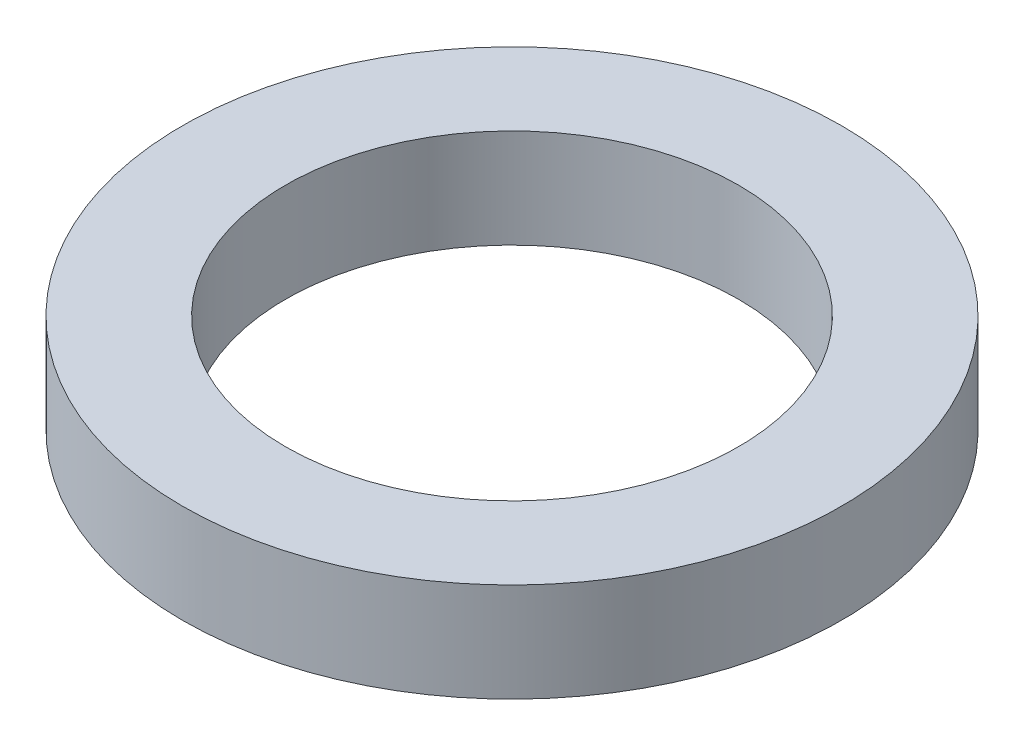
ISO-10303-21;
HEADER;
FILE_DESCRIPTION(('STEP AP214'),'2;1');
FILE_NAME('part.step','',(''),(''),'','','');
FILE_SCHEMA(('AUTOMOTIVE_DESIGN { 1 0 10303 214 1 1 1 1 }'));
ENDSEC;
DATA;
#1=APPLICATION_CONTEXT('core data for automotive mechanical design processes');
#2=APPLICATION_PROTOCOL_DEFINITION('international standard','automotive_design',2000,#1);
#3=PRODUCT_CONTEXT('',#1,'mechanical');
#4=PRODUCT('Part','Part','',(#3));
#5=PRODUCT_RELATED_PRODUCT_CATEGORY('part','',(#4));
#6=PRODUCT_DEFINITION_FORMATION('','',#4);
#7=PRODUCT_DEFINITION_CONTEXT('part definition',#1,'design');
#8=PRODUCT_DEFINITION('design','',#6,#7);
#9=PRODUCT_DEFINITION_SHAPE('','',#8);
#10=(LENGTH_UNIT() NAMED_UNIT(*) SI_UNIT(.MILLI.,.METRE.));
#11=(NAMED_UNIT(*) PLANE_ANGLE_UNIT() SI_UNIT($,.RADIAN.));
#12=(NAMED_UNIT(*) SI_UNIT($,.STERADIAN.) SOLID_ANGLE_UNIT());
#13=UNCERTAINTY_MEASURE_WITH_UNIT(LENGTH_MEASURE(1.E-05),#10,'distance_accuracy_value','');
#14=(GEOMETRIC_REPRESENTATION_CONTEXT(3) GLOBAL_UNCERTAINTY_ASSIGNED_CONTEXT((#13)) GLOBAL_UNIT_ASSIGNED_CONTEXT((#10,
#11,#12)) REPRESENTATION_CONTEXT('',''));
#15=CARTESIAN_POINT('',(0.,0.,0.));
#16=DIRECTION('',(0.,0.,1.));
#17=DIRECTION('',(1.,0.,0.));
#18=AXIS2_PLACEMENT_3D('',#15,#16,#17);
#19=CARTESIAN_POINT('',(0.,12.,0.));
#20=DIRECTION('',(0.,-1.,0.));
#21=DIRECTION('',(0.,0.,-1.));
#22=AXIS2_PLACEMENT_3D('',#19,#20,#21);
#23=CYLINDRICAL_SURFACE('',#22,40.);
#24=CARTESIAN_POINT('',(0.,12.,0.));
#25=DIRECTION('',(0.,1.,0.));
#26=DIRECTION('',(0.,0.,1.));
#27=AXIS2_PLACEMENT_3D('',#24,#25,#26);
#28=CIRCLE('',#27,40.);
#29=CARTESIAN_POINT('',(0.,12.,40.));
#30=VERTEX_POINT('',#29);
#31=EDGE_CURVE('E10',#30,#30,#28,.T.);
#32=ORIENTED_EDGE('',*,*,#31,.F.);
#33=EDGE_LOOP('',(#32));
#34=FACE_BOUND('',#33,.T.);
#35=CARTESIAN_POINT('',(0.,0.,0.));
#36=DIRECTION('',(0.,1.,0.));
#37=DIRECTION('',(0.,0.,1.));
#38=AXIS2_PLACEMENT_3D('',#35,#36,#37);
#39=CIRCLE('',#38,40.);
#40=CARTESIAN_POINT('',(0.,0.,40.));
#41=VERTEX_POINT('',#40);
#42=EDGE_CURVE('E37',#41,#41,#39,.T.);
#43=ORIENTED_EDGE('',*,*,#42,.T.);
#44=EDGE_LOOP('',(#43));
#45=FACE_BOUND('',#44,.T.);
#46=ADVANCED_FACE('F40',(#34,#45),#23,.T.);
#47=CARTESIAN_POINT('',(0.,12.,0.));
#48=DIRECTION('',(0.,1.,0.));
#49=DIRECTION('',(0.,0.,1.));
#50=AXIS2_PLACEMENT_3D('',#47,#48,#49);
#51=PLANE('',#50);
#52=CARTESIAN_POINT('',(0.,12.,0.));
#53=DIRECTION('',(0.,1.,0.));
#54=DIRECTION('',(0.,0.,1.));
#55=AXIS2_PLACEMENT_3D('',#52,#53,#54);
#56=CIRCLE('',#55,27.5);
#57=CARTESIAN_POINT('',(0.,12.,27.5));
#58=VERTEX_POINT('',#57);
#59=EDGE_CURVE('E50',#58,#58,#56,.T.);
#60=ORIENTED_EDGE('',*,*,#59,.F.);
#61=EDGE_LOOP('',(#60));
#62=FACE_BOUND('',#61,.T.);
#63=ORIENTED_EDGE('',*,*,#31,.T.);
#64=EDGE_LOOP('',(#63));
#65=FACE_BOUND('',#64,.T.);
#66=ADVANCED_FACE('F59',(#62,#65),#51,.T.);
#67=CARTESIAN_POINT('',(0.,0.,0.));
#68=DIRECTION('',(0.,1.,0.));
#69=DIRECTION('',(0.,0.,1.));
#70=AXIS2_PLACEMENT_3D('',#67,#68,#69);
#71=PLANE('',#70);
#72=CARTESIAN_POINT('',(0.,0.,0.));
#73=DIRECTION('',(0.,1.,0.));
#74=DIRECTION('',(0.,0.,1.));
#75=AXIS2_PLACEMENT_3D('',#72,#73,#74);
#76=CIRCLE('',#75,27.5);
#77=CARTESIAN_POINT('',(0.,0.,27.5));
#78=VERTEX_POINT('',#77);
#79=EDGE_CURVE('E47',#78,#78,#76,.T.);
#80=ORIENTED_EDGE('',*,*,#79,.T.);
#81=EDGE_LOOP('',(#80));
#82=FACE_BOUND('',#81,.T.);
#83=ORIENTED_EDGE('',*,*,#42,.F.);
#84=EDGE_LOOP('',(#83));
#85=FACE_BOUND('',#84,.T.);
#86=ADVANCED_FACE('F58',(#82,#85),#71,.F.);
#87=CARTESIAN_POINT('',(0.,12.,0.));
#88=DIRECTION('',(0.,-1.,0.));
#89=DIRECTION('',(0.,0.,-1.));
#90=AXIS2_PLACEMENT_3D('',#87,#88,#89);
#91=CYLINDRICAL_SURFACE('',#90,27.5);
#92=ORIENTED_EDGE('',*,*,#59,.T.);
#93=EDGE_LOOP('',(#92));
#94=FACE_BOUND('',#93,.T.);
#95=ORIENTED_EDGE('',*,*,#79,.F.);
#96=EDGE_LOOP('',(#95));
#97=FACE_BOUND('',#96,.T.);
#98=ADVANCED_FACE('F54',(#94,#97),#91,.F.);
#99=CLOSED_SHELL('',(#46,#66,#86,#98));
#100=MANIFOLD_SOLID_BREP('B2',#99);
#101=ADVANCED_BREP_SHAPE_REPRESENTATION('',(#18,#100),#14);
#102=SHAPE_DEFINITION_REPRESENTATION(#9,#101);
ENDSEC;
END-ISO-10303-21;
